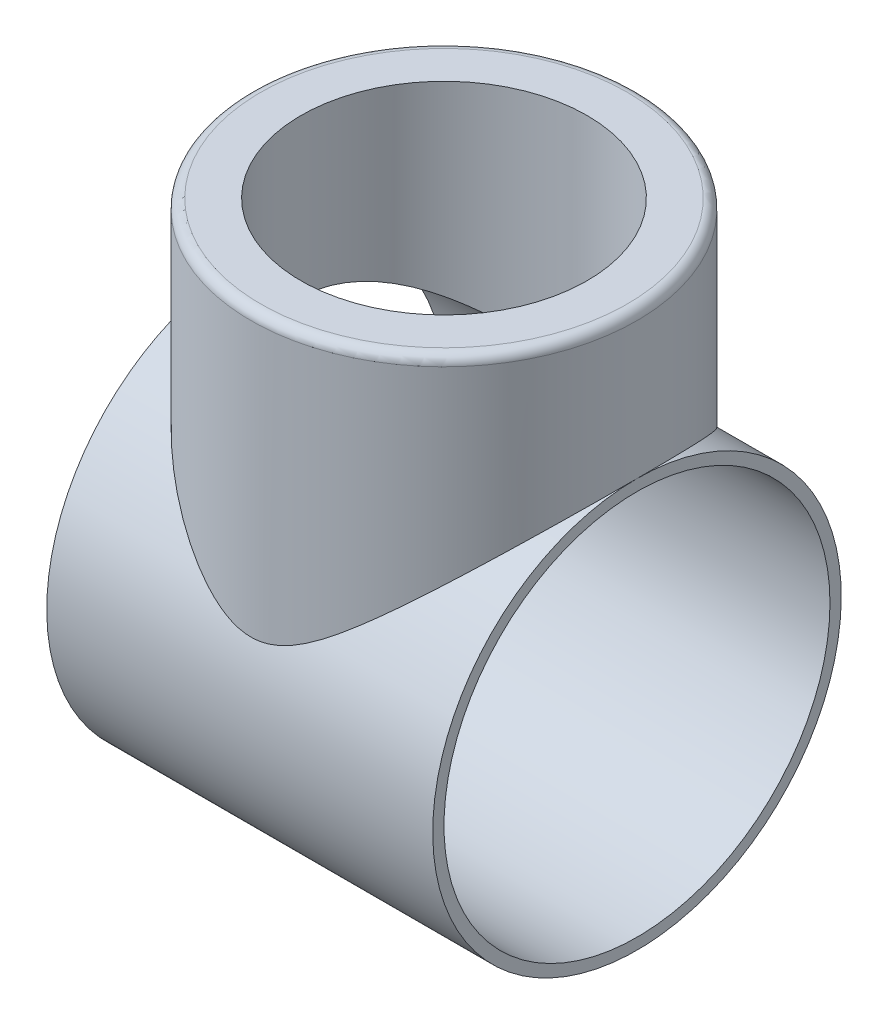
ISO-10303-21;
HEADER;
FILE_DESCRIPTION(('STEP AP214'),'2;1');
FILE_NAME('part.step','',(''),(''),'','','');
FILE_SCHEMA(('AUTOMOTIVE_DESIGN { 1 0 10303 214 1 1 1 1 }'));
ENDSEC;
DATA;
#1=APPLICATION_CONTEXT('core data for automotive mechanical design processes');
#2=APPLICATION_PROTOCOL_DEFINITION('international standard','automotive_design',2000,#1);
#3=PRODUCT_CONTEXT('',#1,'mechanical');
#4=PRODUCT('Part','Part','',(#3));
#5=PRODUCT_RELATED_PRODUCT_CATEGORY('part','',(#4));
#6=PRODUCT_DEFINITION_FORMATION('','',#4);
#7=PRODUCT_DEFINITION_CONTEXT('part definition',#1,'design');
#8=PRODUCT_DEFINITION('design','',#6,#7);
#9=PRODUCT_DEFINITION_SHAPE('','',#8);
#10=(LENGTH_UNIT() NAMED_UNIT(*) SI_UNIT(.MILLI.,.METRE.));
#11=(NAMED_UNIT(*) PLANE_ANGLE_UNIT() SI_UNIT($,.RADIAN.));
#12=(NAMED_UNIT(*) SI_UNIT($,.STERADIAN.) SOLID_ANGLE_UNIT());
#13=UNCERTAINTY_MEASURE_WITH_UNIT(LENGTH_MEASURE(1.E-05),#10,'distance_accuracy_value','');
#14=(GEOMETRIC_REPRESENTATION_CONTEXT(3) GLOBAL_UNCERTAINTY_ASSIGNED_CONTEXT((#13)) GLOBAL_UNIT_ASSIGNED_CONTEXT((#10,
#11,#12)) REPRESENTATION_CONTEXT('',''));
#15=CARTESIAN_POINT('',(0.,0.,0.));
#16=DIRECTION('',(0.,0.,1.));
#17=DIRECTION('',(1.,0.,0.));
#18=AXIS2_PLACEMENT_3D('',#15,#16,#17);
#19=CARTESIAN_POINT('',(-60.,0.,0.));
#20=DIRECTION('',(1.,0.,0.));
#21=DIRECTION('',(0.,0.,-1.));
#22=AXIS2_PLACEMENT_3D('',#19,#20,#21);
#23=CYLINDRICAL_SURFACE('',#22,60.);
#24=CARTESIAN_POINT('',(60.,0.,0.));
#25=DIRECTION('',(1.,0.,0.));
#26=DIRECTION('',(0.,0.,-1.));
#27=AXIS2_PLACEMENT_3D('',#24,#25,#26);
#28=CIRCLE('',#27,60.);
#29=CARTESIAN_POINT('',(60.,0.,-60.));
#30=VERTEX_POINT('',#29);
#31=EDGE_CURVE('E58',#30,#30,#28,.T.);
#32=ORIENTED_EDGE('',*,*,#31,.T.);
#33=EDGE_LOOP('',(#32));
#34=FACE_BOUND('',#33,.T.);
#35=CARTESIAN_POINT('',(-60.,0.,0.));
#36=DIRECTION('',(1.,0.,0.));
#37=DIRECTION('',(0.,0.,-1.));
#38=AXIS2_PLACEMENT_3D('',#35,#36,#37);
#39=CIRCLE('',#38,60.);
#40=CARTESIAN_POINT('',(-60.,0.,-60.));
#41=VERTEX_POINT('',#40);
#42=EDGE_CURVE('E101',#41,#41,#39,.T.);
#43=ORIENTED_EDGE('',*,*,#42,.F.);
#44=EDGE_LOOP('',(#43));
#45=FACE_BOUND('',#44,.T.);
#46=CARTESIAN_POINT('',(0.,40.2461178252015,-44.5));
#47=CARTESIAN_POINT('',(0.521950340710105,40.2461091874401,-44.5000042882494));
#48=CARTESIAN_POINT('',(1.04383948497891,40.2562813467974,-44.4908134860222));
#49=CARTESIAN_POINT('',(2.08624468800879,40.29679076695,-44.4541277588759));
#50=CARTESIAN_POINT('',(2.60676066855394,40.3271291525426,-44.4266318129637));
#51=CARTESIAN_POINT('',(3.64504853630487,40.4075295655595,-44.353517329002));
#52=CARTESIAN_POINT('',(4.16282007227801,40.4575940585679,-44.3078965255041));
#53=CARTESIAN_POINT('',(5.19431452475009,40.5766947814115,-44.1988491619566));
#54=CARTESIAN_POINT('',(5.70803686242041,40.6457336747779,-44.1354201020462));
#55=CARTESIAN_POINT('',(7.24359513295137,40.8802693471307,-43.9186705620038));
#56=CARTESIAN_POINT('',(8.25776608674282,41.0730198952663,-43.7390345051422));
#57=CARTESIAN_POINT('',(10.257564643931,41.5212745320888,-43.3137226483211));
#58=CARTESIAN_POINT('',(11.2431912015059,41.7767809168073,-43.068044432063));
#59=CARTESIAN_POINT('',(13.1683910438996,42.3357936145265,-42.5186066248349));
#60=CARTESIAN_POINT('',(14.1084079437203,42.6386010337178,-42.2156810096681));
#61=CARTESIAN_POINT('',(15.9539269275721,43.2842945061565,-41.5533826240879));
#62=CARTESIAN_POINT('',(16.8594298899541,43.627179538558,-41.1940112913641));
#63=CARTESIAN_POINT('',(18.6345171116782,44.3433852758225,-40.4220393745185));
#64=CARTESIAN_POINT('',(19.5041118289542,44.7166970236494,-40.009454434771));
#65=CARTESIAN_POINT('',(21.2071478906121,45.4853354810806,-39.1334121551078));
#66=CARTESIAN_POINT('',(22.0405865870086,45.8806637983028,-38.6699510978862));
#67=CARTESIAN_POINT('',(23.8366942513597,46.767617311318,-37.5948011891203));
#68=CARTESIAN_POINT('',(24.7912022086411,47.2624844601025,-36.9721303467494));
#69=CARTESIAN_POINT('',(26.6465675245206,48.261565680328,-35.6581377576236));
#70=CARTESIAN_POINT('',(27.5474205383753,48.7657805043797,-34.9668104634265));
#71=CARTESIAN_POINT('',(29.2952372557201,49.7739969690618,-33.5161235927462));
#72=CARTESIAN_POINT('',(30.1421256550589,50.2779973773472,-32.756672361943));
#73=CARTESIAN_POINT('',(31.778415864999,51.275700055055,-31.1717762181585));
#74=CARTESIAN_POINT('',(32.5678130326399,51.7694014904457,-30.346325986402));
#75=CARTESIAN_POINT('',(34.2360957924212,52.8334127397948,-28.4608944512654));
#76=CARTESIAN_POINT('',(35.1017938682631,53.3995579491807,-27.3868198685674));
#77=CARTESIAN_POINT('',(36.7388816469887,54.4896567975256,-25.1480955787368));
#78=CARTESIAN_POINT('',(37.5102508272926,55.0136012466809,-23.9834262512978));
#79=CARTESIAN_POINT('',(38.5884296851264,55.7561611927072,-22.1737546625714));
#80=CARTESIAN_POINT('',(38.9344445874246,55.996289592825,-21.5605741567996));
#81=CARTESIAN_POINT('',(39.5992657729467,56.4605628572466,-20.3137179214327));
#82=CARTESIAN_POINT('',(39.9180737273749,56.6847087031497,-19.6800434539945));
#83=CARTESIAN_POINT('',(40.5269396885394,57.1151163559301,-18.3935670488333));
#84=CARTESIAN_POINT('',(40.8170136671901,57.3213880901394,-17.7407760015974));
#85=CARTESIAN_POINT('',(41.367283893526,57.7145139820236,-16.4168180955821));
#86=CARTESIAN_POINT('',(41.6274729718284,57.9013634792897,-15.7456468750289));
#87=CARTESIAN_POINT('',(42.2160536104265,58.3257078564334,-14.1098261539199));
#88=CARTESIAN_POINT('',(42.5291096534308,58.5528683078576,-13.1368990351965));
#89=CARTESIAN_POINT('',(43.0893465453492,58.9610459401474,-11.1628943464204));
#90=CARTESIAN_POINT('',(43.336542803193,59.1420739139977,-10.1618234217544));
#91=CARTESIAN_POINT('',(43.6554372000947,59.3762755689208,-8.6440871772517));
#92=CARTESIAN_POINT('',(43.7530730054295,59.4481102596546,-8.13557560487839));
#93=CARTESIAN_POINT('',(43.9307501982228,59.5789994743003,-7.11392105689515));
#94=CARTESIAN_POINT('',(44.0107948440874,59.6380563650094,-6.60077895735988));
#95=CARTESIAN_POINT('',(44.1530120978249,59.7430847523843,-5.57062792558039));
#96=CARTESIAN_POINT('',(44.2151826797549,59.7890547657069,-5.05361856180834));
#97=CARTESIAN_POINT('',(44.3214117367221,59.8676564997752,-4.01674246446689));
#98=CARTESIAN_POINT('',(44.3654693389796,59.9002875777797,-3.49687559443048));
#99=CARTESIAN_POINT('',(44.4703501236668,59.9779923563319,-1.9318670440071));
#100=CARTESIAN_POINT('',(44.5035602840376,60.0026399674937,-0.88363602968756));
#101=CARTESIAN_POINT('',(44.4958330595716,59.9969100963708,1.21224592845824));
#102=CARTESIAN_POINT('',(44.4548959647422,59.9665328293014,2.25989687453725));
#103=CARTESIAN_POINT('',(44.2995376296408,59.8514519760434,4.34695695359885));
#104=CARTESIAN_POINT('',(44.1851013218437,59.7667372505429,5.38636435239261));
#105=CARTESIAN_POINT('',(43.8844904701222,59.5448422310987,7.44901649884121));
#106=CARTESIAN_POINT('',(43.6983163060761,59.4076622149783,8.47226133205295));
#107=CARTESIAN_POINT('',(43.2641008547636,59.0890127256266,10.4628678346911));
#108=CARTESIAN_POINT('',(43.01826041709,58.9091228962178,11.4309658277476));
#109=CARTESIAN_POINT('',(42.4650233393857,58.5063437246237,13.3401503805873));
#110=CARTESIAN_POINT('',(42.1576284675576,58.2834556176068,14.2812377153866));
#111=CARTESIAN_POINT('',(41.4846675568433,57.7985571326788,16.1320211676757));
#112=CARTESIAN_POINT('',(41.1190966396067,57.5365434740096,17.0417146448432));
#113=CARTESIAN_POINT('',(40.3333455968536,56.9776492982644,18.8260933971558));
#114=CARTESIAN_POINT('',(39.9131622370173,56.6807667162419,19.7007765948666));
#115=CARTESIAN_POINT('',(38.973005458837,56.022499557773,21.5058204330082));
#116=CARTESIAN_POINT('',(38.447145875456,55.6576115664077,22.4318370619908));
#117=CARTESIAN_POINT('',(37.3370135215526,54.8966231580356,24.2346518194598));
#118=CARTESIAN_POINT('',(36.7527371551884,54.5005208199496,25.1114469129235));
#119=CARTESIAN_POINT('',(35.5293085248845,53.6830922067384,26.8145183935474));
#120=CARTESIAN_POINT('',(34.8901161360653,53.2617475573133,27.6407570734165));
#121=CARTESIAN_POINT('',(33.5606121215878,52.4004604406604,29.2406792745826));
#122=CARTESIAN_POINT('',(32.870298061972,51.9605170883568,30.0143602901862));
#123=CARTESIAN_POINT('',(31.3024484369485,50.9818427894829,31.6532889949493));
#124=CARTESIAN_POINT('',(30.4145893453604,50.4405197225372,32.5071389666396));
#125=CARTESIAN_POINT('',(28.5731712452284,49.3520446269879,34.1370213226318));
#126=CARTESIAN_POINT('',(27.6195994067465,48.8048914778322,34.9130384375959));
#127=CARTESIAN_POINT('',(25.6486318538073,47.7171498458324,36.3855978659591));
#128=CARTESIAN_POINT('',(24.6312091197479,47.1765642592419,37.0821061775823));
#129=CARTESIAN_POINT('',(22.5342509045028,46.116418432799,38.3925212205582));
#130=CARTESIAN_POINT('',(21.4547302842137,45.5968532127562,39.006447598487));
#131=CARTESIAN_POINT('',(19.4624345702153,44.6980671169939,40.0305783513116));
#132=CARTESIAN_POINT('',(18.5609538061182,44.3119394783666,40.456726223778));
#133=CARTESIAN_POINT('',(16.7197604126817,43.572807752645,41.2517262412505));
#134=CARTESIAN_POINT('',(15.7800487337206,43.2198028428767,41.6205798094328));
#135=CARTESIAN_POINT('',(13.8656151236316,42.5581977274057,42.296847572139));
#136=CARTESIAN_POINT('',(12.8909619150813,42.249515755869,42.6043753175112));
#137=CARTESIAN_POINT('',(10.9079654832495,41.6872994375876,43.1546536827896));
#138=CARTESIAN_POINT('',(9.89963037601222,41.4337519145739,43.3974197828659));
#139=CARTESIAN_POINT('',(8.04368455823555,41.0339903275956,43.7752515698321));
#140=CARTESIAN_POINT('',(7.20084207288908,40.8765977494339,43.9219324868934));
#141=CARTESIAN_POINT('',(5.50041819802821,40.6115732475786,44.1671019477012));
#142=CARTESIAN_POINT('',(4.64283865424277,40.5039351388694,44.2655964816223));
#143=CARTESIAN_POINT('',(2.91911830773351,40.3427295547646,44.4125677286822));
#144=CARTESIAN_POINT('',(2.05298633650212,40.2891112096413,44.4610914996129));
#145=CARTESIAN_POINT('',(0.317674362643003,40.2380272726962,44.5073296836804));
#146=CARTESIAN_POINT('',(-0.55150568599144,40.2405625321182,44.505043326576));
#147=CARTESIAN_POINT('',(-2.28596227436666,40.3016700196146,44.4497135761221));
#148=CARTESIAN_POINT('',(-3.15123997960492,40.3602242255133,44.3966865068562));
#149=CARTESIAN_POINT('',(-4.87190451576451,40.5308806498048,44.240941803076));
#150=CARTESIAN_POINT('',(-5.72729134396141,40.642982882947,44.1382241548749));
#151=CARTESIAN_POINT('',(-7.4240653876941,40.9165547676885,43.8847377234221));
#152=CARTESIAN_POINT('',(-8.26543150123807,41.0780927929654,43.7339023771944));
#153=CARTESIAN_POINT('',(-9.92893795590823,41.4448438963211,43.3865023518875));
#154=CARTESIAN_POINT('',(-10.7510755777273,41.6500631108678,43.1899312473468));
#155=CARTESIAN_POINT('',(-12.6870807095658,42.1846332622747,42.6690124944642));
#156=CARTESIAN_POINT('',(-13.7908179644599,42.5312978618984,42.3246484503561));
#157=CARTESIAN_POINT('',(-15.9516144607349,43.2801948728189,41.5585305214342));
#158=CARTESIAN_POINT('',(-17.0086544471686,43.6824499289662,41.1367450758049));
#159=CARTESIAN_POINT('',(-19.0755684632273,44.527930076714,40.2200546403792));
#160=CARTESIAN_POINT('',(-20.0853647652594,44.9712193419744,39.7250343695755));
#161=CARTESIAN_POINT('',(-22.0550882608731,45.884808424398,38.6661782679115));
#162=CARTESIAN_POINT('',(-23.0150204412288,46.355105530638,38.1023493373789));
#163=CARTESIAN_POINT('',(-24.9161621372768,47.3273236161702,36.8883376618597));
#164=CARTESIAN_POINT('',(-25.8556469650214,47.8297762042605,36.2358830733489));
#165=CARTESIAN_POINT('',(-27.679910014823,48.8400529111134,34.8622472738526));
#166=CARTESIAN_POINT('',(-28.5646860737176,49.3478772413438,34.1410633481983));
#167=CARTESIAN_POINT('',(-30.2772938766035,50.358584957203,32.6318457992776));
#168=CARTESIAN_POINT('',(-31.1051561867018,50.8614708686789,31.8438485747471));
#169=CARTESIAN_POINT('',(-32.7017712726705,51.853299207555,30.2019087999941));
#170=CARTESIAN_POINT('',(-33.470525540107,52.3422419866083,29.3479679149222));
#171=CARTESIAN_POINT('',(-34.9471366600719,53.2985479551122,27.5732364539518));
#172=CARTESIAN_POINT('',(-35.6548356260329,53.7658538285782,26.6522832808933));
#173=CARTESIAN_POINT('',(-37.0025002306692,54.6688659515999,24.7472453764052));
#174=CARTESIAN_POINT('',(-37.6424632932466,55.1045709991306,23.7631582461808));
#175=CARTESIAN_POINT('',(-38.8486279933934,55.9354535238626,21.7353357344004));
#176=CARTESIAN_POINT('',(-39.4148771427242,56.3306570707044,20.6916394040002));
#177=CARTESIAN_POINT('',(-40.4677394262983,57.0723077490861,18.5482327967657));
#178=CARTESIAN_POINT('',(-40.954366559355,57.4187634497671,17.4485324110101));
#179=CARTESIAN_POINT('',(-41.7734480273411,58.0060562896384,15.3713226943041));
#180=CARTESIAN_POINT('',(-42.1180999819418,58.2549428335656,14.4008872247955));
#181=CARTESIAN_POINT('',(-42.7416054367343,58.7073143426455,12.4287679411175));
#182=CARTESIAN_POINT('',(-43.0204651989122,58.9108036285294,11.4270871111101));
#183=CARTESIAN_POINT('',(-43.5086322607101,59.2682330369469,9.39874524150024));
#184=CARTESIAN_POINT('',(-43.7179750064187,59.4221984100089,8.37209721993441));
#185=CARTESIAN_POINT('',(-44.0642873146111,59.6774471738407,6.30013580032234));
#186=CARTESIAN_POINT('',(-44.2012560659236,59.7787299741415,5.25482219320709));
#187=CARTESIAN_POINT('',(-44.4009995850255,59.9265736105224,3.14995644098688));
#188=CARTESIAN_POINT('',(-44.4635423875705,59.9729633575138,2.09037013500847));
#189=CARTESIAN_POINT('',(-44.5126410521356,60.0093737571475,-0.0315402479794816));
#190=CARTESIAN_POINT('',(-44.49919675987,59.9993942953369,-1.09386433054349));
#191=CARTESIAN_POINT('',(-44.3965384869147,59.9232964064283,-3.21290418427762));
#192=CARTESIAN_POINT('',(-44.3073172142214,59.8571725765695,-4.26961940586038));
#193=CARTESIAN_POINT('',(-44.0545293478902,59.6702967677894,-6.36918090875246));
#194=CARTESIAN_POINT('',(-43.8909640703089,59.5495457558927,-7.41202743523263));
#195=CARTESIAN_POINT('',(-43.5013980468378,59.2630163329123,-9.42773117519935));
#196=CARTESIAN_POINT('',(-43.2786998341044,59.0996258396571,-10.4015717985618));
#197=CARTESIAN_POINT('',(-42.7709367825483,58.7288085972727,-12.3241853536313));
#198=CARTESIAN_POINT('',(-42.4858743947813,58.5213835788113,-13.2729592688756));
#199=CARTESIAN_POINT('',(-41.8566393162162,58.0661784465417,-15.1407765123869));
#200=CARTESIAN_POINT('',(-41.5124612489804,57.818394662301,-16.0598171274347));
#201=CARTESIAN_POINT('',(-40.7685039846635,57.2865888952406,-17.864256334358));
#202=CARTESIAN_POINT('',(-40.3687215084379,57.0025647753105,-18.7496529382301));
#203=CARTESIAN_POINT('',(-39.4756743282588,56.373476215924,-20.5680435948418));
#204=CARTESIAN_POINT('',(-38.9771009809435,56.0251623487047,-21.4973049359076));
#205=CARTESIAN_POINT('',(-37.9216627541991,55.2960838893367,-23.3087229625223));
#206=CARTESIAN_POINT('',(-37.3647947388914,54.9153175516585,-24.1908771101481));
#207=CARTESIAN_POINT('',(-36.196421767278,54.1271171877636,-25.9065023282224));
#208=CARTESIAN_POINT('',(-35.5848840858751,53.7196672283635,-26.7399437390662));
#209=CARTESIAN_POINT('',(-34.3109233963292,52.8843847752664,-28.3561187012408));
#210=CARTESIAN_POINT('',(-33.6484978667809,52.4565512719992,-29.1388497364131));
#211=CARTESIAN_POINT('',(-32.1442957713006,51.5034469314094,-30.797337438415));
#212=CARTESIAN_POINT('',(-31.2924453848203,50.9751879296599,-31.6622617350211));
#213=CARTESIAN_POINT('',(-29.5241829089023,49.9092126334412,-33.3172559849402));
#214=CARTESIAN_POINT('',(-28.6077594512591,49.3714946862736,-34.1073126999826));
#215=CARTESIAN_POINT('',(-26.7122623392538,48.297870061859,-35.6113733885586));
#216=CARTESIAN_POINT('',(-25.7331462834457,47.7619648741604,-36.3253250006942));
#217=CARTESIAN_POINT('',(-23.7143783853228,46.7052659315094,-37.6742851619448));
#218=CARTESIAN_POINT('',(-22.6747375816564,46.184469446795,-38.3093080404504));
#219=CARTESIAN_POINT('',(-20.7074274646056,45.2539753190545,-39.4018648234355));
#220=CARTESIAN_POINT('',(-19.7885739385137,44.8398636275907,-39.8715266699809));
#221=CARTESIAN_POINT('',(-17.9091303612557,44.0427382109742,-40.7503257680393));
#222=CARTESIAN_POINT('',(-16.9485395648822,43.6597250414274,-41.1594619383084));
#223=CARTESIAN_POINT('',(-14.9886766513092,42.9369595143049,-41.9128813803387));
#224=CARTESIAN_POINT('',(-13.9894816994186,42.5971261433523,-42.2572866992272));
#225=CARTESIAN_POINT('',(-11.9533246844578,41.972544556354,-42.877728409414));
#226=CARTESIAN_POINT('',(-10.9163746735275,41.6877789416741,-43.1537864027726));
#227=CARTESIAN_POINT('',(-9.06795056486468,41.2478015067845,-43.5739296071159));
#228=CARTESIAN_POINT('',(-8.26352200117434,41.0779436302794,-43.7337772467831));
#229=CARTESIAN_POINT('',(-6.63919931287222,40.7822487862483,-44.0096492737428));
#230=CARTESIAN_POINT('',(-5.8193077359748,40.6564046325783,-44.1256808151597));
#231=CARTESIAN_POINT('',(-4.16918296146037,40.4532122182416,-44.3120376887577));
#232=CARTESIAN_POINT('',(-3.33896078214854,40.375816164653,-44.3824080671271));
#233=CARTESIAN_POINT('',(-1.6724406360641,40.2722721227382,-44.4763892223377));
#234=CARTESIAN_POINT('',(-0.836141794890599,40.2461316625205,-44.4999931304106));
#235=CARTESIAN_POINT('',(0.,40.2461178252015,-44.5));
#236=B_SPLINE_CURVE_WITH_KNOTS('',3,(#46,#47,#48,#49,#50,#51,#52,#53,#54,#55,#56,#57,#58,#59,
#60,#61,#62,#63,#64,#65,#66,#67,#68,#69,#70,#71,#72,#73,#74,#75,#76,#77,#78,#79,#80,#81,#82,#83,
#84,#85,#86,#87,#88,#89,#90,#91,#92,#93,#94,#95,#96,#97,#98,#99,#100,#101,#102,#103,#104,#105,
#106,#107,#108,#109,#110,#111,#112,#113,#114,#115,#116,#117,#118,#119,#120,#121,#122,#123,#124,
#125,#126,#127,#128,#129,#130,#131,#132,#133,#134,#135,#136,#137,#138,#139,#140,#141,#142,#143,
#144,#145,#146,#147,#148,#149,#150,#151,#152,#153,#154,#155,#156,#157,#158,#159,#160,#161,#162,
#163,#164,#165,#166,#167,#168,#169,#170,#171,#172,#173,#174,#175,#176,#177,#178,#179,#180,#181,
#182,#183,#184,#185,#186,#187,#188,#189,#190,#191,#192,#193,#194,#195,#196,#197,#198,#199,#200,
#201,#202,#203,#204,#205,#206,#207,#208,#209,#210,#211,#212,#213,#214,#215,#216,#217,#218,#219,
#220,#221,#222,#223,#224,#225,#226,#227,#228,#229,#230,#231,#232,#233,#234,#235),.UNSPECIFIED.,
.T.,.F.,(4,2,2,2,2,2,2,2,2,2,2,2,2,2,2,2,2,2,2,2,2,2,2,2,2,2,2,2,2,2,2,2,2,2,2,2,2,2,2,2,2,2,2,
2,2,2,2,2,2,2,2,2,2,2,2,2,2,2,2,2,2,2,2,2,2,2,2,2,2,2,2,2,2,2,2,2,2,2,2,2,2,2,2,2,2,2,2,2,2,2,2,
2,2,2,4),(0.,1.56556517147146,3.13121767169813,4.69706592637481,6.26313409934394,
9.40144702949159,12.5398747973961,15.6356864170503,18.7314191982175,21.826243924496,
24.9212949274269,28.6453743115329,32.3697548465043,36.099223572733,39.8289931555986,
44.2965662154786,48.7651095360273,50.9960052618935,53.2267638547709,55.4562754288435,
57.6863207501565,60.823899258746,63.9607430356961,65.5286258562801,67.0962180130722,
68.6639877792385,70.2318330800318,73.3745578864826,76.5172704010164,79.660627385307,
82.8039677245902,85.8454248664966,88.8867946525303,91.9284196070492,94.9702247782702,
98.3440535849777,101.718090195545,105.09461339013,108.471297448081,112.503760025058,
116.53701215405,120.57198268409,124.605991574121,127.81141806161,131.016764914371,
134.216120486931,137.4147106213,140.021682558505,142.62833033385,145.23252116116,
147.836751465953,150.440144230556,153.04353771224,155.650548295344,158.257925361325,
161.873592564132,165.490736979422,169.113637051068,172.736174106099,176.48094468703,
180.225863240111,183.968754575554,187.71155142972,191.463753733026,195.216098686979,
198.966012991889,202.715267292296,205.890427517031,209.065285413528,212.238521984498,
215.411794120498,218.594930785149,221.778073912902,224.961523388583,228.144916512222,
231.17841403459,234.211792354927,237.245446700401,240.279280024709,243.607858112388,
246.936615348285,250.267378683901,253.598307159686,257.566177425562,261.534747995964,
265.506031612056,269.476593191306,272.809775718956,276.14301778413,279.46991070141,
282.795750764736,285.306240089339,287.816319333457,290.323918524506,292.831885988828),.UNSPECIFIED.);
#237=CARTESIAN_POINT('',(0.,40.2461178252015,-44.5));
#238=VERTEX_POINT('',#237);
#239=EDGE_CURVE('E19',#238,#238,#236,.T.);
#240=ORIENTED_EDGE('',*,*,#239,.F.);
#241=EDGE_LOOP('',(#240));
#242=FACE_BOUND('',#241,.T.);
#243=ADVANCED_FACE('F14',(#34,#45,#242),#23,.F.);
#244=CARTESIAN_POINT('',(0.,0.,0.));
#245=DIRECTION('',(0.,-1.,0.));
#246=DIRECTION('',(0.,0.,-1.));
#247=AXIS2_PLACEMENT_3D('',#244,#245,#246);
#248=CYLINDRICAL_SURFACE('',#247,60.);
#249=CARTESIAN_POINT('',(0.,106.,0.));
#250=DIRECTION('',(0.,-1.,0.));
#251=DIRECTION('',(0.,0.,-1.));
#252=AXIS2_PLACEMENT_3D('',#249,#250,#251);
#253=CIRCLE('',#252,60.);
#254=CARTESIAN_POINT('',(0.,106.,-60.));
#255=VERTEX_POINT('',#254);
#256=EDGE_CURVE('E9',#255,#255,#253,.T.);
#257=ORIENTED_EDGE('',*,*,#256,.T.);
#258=EDGE_LOOP('',(#257));
#259=FACE_BOUND('',#258,.T.);
#260=CARTESIAN_POINT('',(0.,20.7906228862918,-60.));
#261=CARTESIAN_POINT('',(0.758528909390587,20.7906687322399,-59.9999904065511));
#262=CARTESIAN_POINT('',(1.51729366262084,20.8324790088875,-59.98554699321));
#263=CARTESIAN_POINT('',(3.02541119739763,20.9961734248151,-59.9284381571005));
#264=CARTESIAN_POINT('',(3.77475470966428,21.1181309601118,-59.8857468656814));
#265=CARTESIAN_POINT('',(5.26008636130046,21.4333476508569,-59.7736517022794));
#266=CARTESIAN_POINT('',(5.99598309437329,21.6269798770012,-59.7041079787402));
#267=CARTESIAN_POINT('',(7.44660432062503,22.0731706531462,-59.5405851678695));
#268=CARTESIAN_POINT('',(8.16132786930634,22.3257318274138,-59.4466049922948));
#269=CARTESIAN_POINT('',(9.41850242889429,22.8188288099898,-59.2587975120337));
#270=CARTESIAN_POINT('',(9.96516431764428,23.0504265040595,-59.1692185698772));
#271=CARTESIAN_POINT('',(11.0454442017346,23.5376156349974,-58.9771073554713));
#272=CARTESIAN_POINT('',(11.5790596845841,23.7932116483219,-58.8745726112687));
#273=CARTESIAN_POINT('',(12.6342055594526,24.3241678903389,-58.6572009071734));
#274=CARTESIAN_POINT('',(13.1557274926231,24.5995414317841,-58.5423556346522));
#275=CARTESIAN_POINT('',(14.1871816507752,25.166256868166,-58.3009810156804));
#276=CARTESIAN_POINT('',(14.6971145190673,25.4575978736686,-58.1744523197619));
#277=CARTESIAN_POINT('',(15.7078218450643,26.0541498508793,-57.9097406057808));
#278=CARTESIAN_POINT('',(16.2085648488496,26.3593992025115,-57.7715243095543));
#279=CARTESIAN_POINT('',(17.2002231418555,26.980521261027,-57.4840737539756));
#280=CARTESIAN_POINT('',(17.6911376592914,27.2963947969985,-57.3348386336471));
#281=CARTESIAN_POINT('',(19.1499499190291,28.2565531409301,-56.8710945910735));
#282=CARTESIAN_POINT('',(20.1043443165854,28.9136328016263,-56.5404340934388));
#283=CARTESIAN_POINT('',(22.0039769964669,30.2649996523406,-55.8290004142343));
#284=CARTESIAN_POINT('',(22.9484730965435,30.9597983411099,-55.4472322243461));
#285=CARTESIAN_POINT('',(24.8087273501631,32.3627900030287,-54.640232118589));
#286=CARTESIAN_POINT('',(25.7244808693601,33.0709851069629,-54.2149932402454));
#287=CARTESIAN_POINT('',(27.5301587030445,34.4942177445593,-53.3207838963083));
#288=CARTESIAN_POINT('',(28.4200632243271,35.2092599917402,-52.8517810198544));
#289=CARTESIAN_POINT('',(30.1746375527395,36.6401586498467,-51.8700459354968));
#290=CARTESIAN_POINT('',(31.0393088329444,37.3560150107006,-51.3573162871723));
#291=CARTESIAN_POINT('',(32.7428121268253,38.7830613774666,-50.2883478998282));
#292=CARTESIAN_POINT('',(33.5816780939988,39.4942564530126,-49.7321700686894));
#293=CARTESIAN_POINT('',(35.234669982534,40.9090380230505,-48.5750536608696));
#294=CARTESIAN_POINT('',(36.0487951337687,41.6126242802584,-47.9741136928473));
#295=CARTESIAN_POINT('',(37.6510954118819,43.0081407004995,-46.7271330486956));
#296=CARTESIAN_POINT('',(38.4392848277944,43.7000771756526,-46.0811178399591));
#297=CARTESIAN_POINT('',(39.9888399141275,45.0691221589826,-44.7430488200409));
#298=CARTESIAN_POINT('',(40.7502076319229,45.7462317974337,-44.0509985345428));
#299=CARTESIAN_POINT('',(42.5829204522391,47.3847886646905,-42.2960309164036));
#300=CARTESIAN_POINT('',(43.6385274405875,48.3361625708875,-41.2070707142414));
#301=CARTESIAN_POINT('',(45.6828552063846,50.1895163052427,-38.9283808789139));
#302=CARTESIAN_POINT('',(46.6715760592437,51.0914961890899,-37.7386513593641));
#303=CARTESIAN_POINT('',(48.0968489136662,52.397719369308,-35.8789928350597));
#304=CARTESIAN_POINT('',(48.5620560600246,52.8251053584278,-35.2469780635364));
#305=CARTESIAN_POINT('',(49.4722030615757,53.6629970827709,-33.9576752372917));
#306=CARTESIAN_POINT('',(49.9171443182551,54.0735039850751,-33.3003889360368));
#307=CARTESIAN_POINT('',(50.785239676417,54.8758885887138,-31.9608542168824));
#308=CARTESIAN_POINT('',(51.2084000426182,55.2677716442079,-31.2786130742796));
#309=CARTESIAN_POINT('',(52.0316481010739,56.0314086794391,-29.8891272744113));
#310=CARTESIAN_POINT('',(52.4317299163567,56.4031575305253,-29.1818763216913));
#311=CARTESIAN_POINT('',(53.4326006917372,57.3344775183045,-27.3244873901495));
#312=CARTESIAN_POINT('',(54.0148396806077,57.8775849365436,-26.1559284749153));
#313=CARTESIAN_POINT('',(55.1104563481879,58.9013953354424,-23.7606996871457));
#314=CARTESIAN_POINT('',(55.623849737572,59.3821125528359,-22.5340431593334));
#315=CARTESIAN_POINT('',(56.3369569822265,60.0507779860611,-20.6542203035782));
#316=CARTESIAN_POINT('',(56.5651646691798,60.2649336682026,-20.0209651192068));
#317=CARTESIAN_POINT('',(57.001741284094,60.6748948739397,-18.7418762661228));
#318=CARTESIAN_POINT('',(57.2101134658845,60.8707034071312,-18.0960446814612));
#319=CARTESIAN_POINT('',(57.6062016973035,61.2431214762665,-16.7925461809546));
#320=CARTESIAN_POINT('',(57.7939157959858,61.4197291988699,-16.1348781540904));
#321=CARTESIAN_POINT('',(58.1478526247792,61.7528881498504,-14.8087211107725));
#322=CARTESIAN_POINT('',(58.3140744128745,61.9094384991028,-14.1402316214542));
#323=CARTESIAN_POINT('',(58.6254299614442,62.2027997497841,-12.7884212341209));
#324=CARTESIAN_POINT('',(58.7703922744052,62.3394501114345,-12.1050259204838));
#325=CARTESIAN_POINT('',(59.0369866822571,62.5908445998107,-10.7296289567849));
#326=CARTESIAN_POINT('',(59.1586165304059,62.7055866169215,-10.037626484743));
#327=CARTESIAN_POINT('',(59.3778914230342,62.9125001293602,-8.64649196407175));
#328=CARTESIAN_POINT('',(59.475537005446,63.0046721309006,-7.9473600757112));
#329=CARTESIAN_POINT('',(59.6463168139495,63.165911038749,-6.54346262801519));
#330=CARTESIAN_POINT('',(59.7194513133625,63.2349782026974,-5.83869713158943));
#331=CARTESIAN_POINT('',(59.8407758047187,63.3495702561386,-4.42541956584605));
#332=CARTESIAN_POINT('',(59.8889765473168,63.3951052919398,-3.716909244522));
#333=CARTESIAN_POINT('',(59.9602033516643,63.4623971368019,-2.29757972319877));
#334=CARTESIAN_POINT('',(59.9832322842367,63.4841566574395,-1.58676079577034));
#335=CARTESIAN_POINT('',(60.0039892025269,63.5037692257477,-0.164433052004176));
#336=CARTESIAN_POINT('',(60.0017179853667,63.5016230266065,0.547075741891947));
#337=CARTESIAN_POINT('',(59.9719010196848,63.4734503428098,1.96902100026199));
#338=CARTESIAN_POINT('',(59.9443559975306,63.4474245444525,2.67945749496598));
#339=CARTESIAN_POINT('',(59.8337650199722,63.3429462153451,4.63417148601373));
#340=CARTESIAN_POINT('',(59.7244990534306,63.2397297181741,5.87582573496755));
#341=CARTESIAN_POINT('',(59.4302796460327,62.9619393948515,8.34172373501794));
#342=CARTESIAN_POINT('',(59.2453336712804,62.7873726076638,9.56596919122999));
#343=CARTESIAN_POINT('',(58.8027968147367,62.3699728081123,11.989514771222));
#344=CARTESIAN_POINT('',(58.5451991013245,62.1271333759116,13.1888125377168));
#345=CARTESIAN_POINT('',(57.961305301611,61.5772140343237,15.5554813630102));
#346=CARTESIAN_POINT('',(57.6350054065378,61.2701305633253,16.722850647674));
#347=CARTESIAN_POINT('',(56.9088702964539,60.5875710834974,19.050065571891));
#348=CARTESIAN_POINT('',(56.507334178709,60.2105155945908,20.2089148761408));
#349=CARTESIAN_POINT('',(55.6419501166776,59.3991076301619,22.4822789702302));
#350=CARTESIAN_POINT('',(55.1781030216677,58.9647559355682,23.5967943640572));
#351=CARTESIAN_POINT('',(54.1933504392047,58.0442814595975,25.7781503739198));
#352=CARTESIAN_POINT('',(53.6724420871035,57.5581560790584,26.8449885926276));
#353=CARTESIAN_POINT('',(52.5785531216232,56.5394950047237,28.9288943388254));
#354=CARTESIAN_POINT('',(52.0055613586887,56.0069493746984,29.94595113752));
#355=CARTESIAN_POINT('',(50.9564836787026,55.0343933635614,31.6892273695647));
#356=CARTESIAN_POINT('',(50.4903989534606,54.6030819626321,32.4263828230759));
#357=CARTESIAN_POINT('',(49.5330968526136,53.7191212703474,33.870678097755));
#358=CARTESIAN_POINT('',(49.0418837011452,53.2664755663289,34.5778229274382));
#359=CARTESIAN_POINT('',(47.5326431796392,51.8791349918499,36.6548496992369));
#360=CARTESIAN_POINT('',(46.4792485157517,50.915253822379,37.9799383317709));
#361=CARTESIAN_POINT('',(44.2876354690731,48.9227510920271,40.5144742737073));
#362=CARTESIAN_POINT('',(43.1491544240426,47.8939307220679,41.7235347598777));
#363=CARTESIAN_POINT('',(40.799815617742,45.7886694310987,44.0235959738365));
#364=CARTESIAN_POINT('',(39.5889676055663,44.7122349295989,45.1146125487972));
#365=CARTESIAN_POINT('',(37.5566358288247,42.925635713006,46.8033174342971));
#366=CARTESIAN_POINT('',(36.7546948944416,42.225483667487,47.4355079174354));
#367=CARTESIAN_POINT('',(35.1253194151573,40.8150874837224,48.6543643005233));
#368=CARTESIAN_POINT('',(34.2978833639616,40.1048427505247,49.2410275034114));
#369=CARTESIAN_POINT('',(32.6175047511009,38.6775738556822,50.3698696624441));
#370=CARTESIAN_POINT('',(31.7645426975343,37.9605448147293,50.9120133759927));
#371=CARTESIAN_POINT('',(30.0336692030098,36.5244804865607,51.9518821652084));
#372=CARTESIAN_POINT('',(29.155758762104,35.8054452808009,52.4496090180162));
#373=CARTESIAN_POINT('',(27.3763991281173,34.3720787220823,53.3998838019665));
#374=CARTESIAN_POINT('',(26.4750155378331,33.6577400546386,53.852543505548));
#375=CARTESIAN_POINT('',(24.6447075201963,32.237829488663,54.7143663452147));
#376=CARTESIAN_POINT('',(23.7157797059046,31.532258683524,55.1235241035372));
#377=CARTESIAN_POINT('',(21.8287917760074,30.138706864775,55.8976090636547));
#378=CARTESIAN_POINT('',(20.8707704289991,29.4507045136316,56.2625921516717));
#379=CARTESIAN_POINT('',(18.9203529914622,28.1021712098136,56.9481250825322));
#380=CARTESIAN_POINT('',(17.9279688275069,27.4416308974152,57.2686901524572));
#381=CARTESIAN_POINT('',(16.2347758220797,26.3731023134669,57.7662059172242));
#382=CARTESIAN_POINT('',(15.5451042326864,25.9533452186927,57.9557727293178));
#383=CARTESIAN_POINT('',(14.145000998825,25.1397301303381,58.3133016256247));
#384=CARTESIAN_POINT('',(13.4345684860103,24.7458732223051,58.4812628045688));
#385=CARTESIAN_POINT('',(11.9915601861318,23.993105210065,58.794105374896));
#386=CARTESIAN_POINT('',(11.2590148117499,23.6341487403093,58.9390168877664));
#387=CARTESIAN_POINT('',(9.76890030891742,22.9617010121501,59.2042300029197));
#388=CARTESIAN_POINT('',(9.01133819327823,22.6481971428825,59.3245384351666));
#389=CARTESIAN_POINT('',(7.66394620885365,22.1517197827822,59.5113698196047));
#390=CARTESIAN_POINT('',(7.07975187207299,21.9557353810002,59.583813090906));
#391=CARTESIAN_POINT('',(5.89778570076965,21.6036089820242,59.7123876813954));
#392=CARTESIAN_POINT('',(5.30001891891906,21.4474524144445,59.7685249669181));
#393=CARTESIAN_POINT('',(4.09422584327693,21.1817843970081,59.8631939386489));
#394=CARTESIAN_POINT('',(3.4862280029898,21.0721605455251,59.9017680659426));
#395=CARTESIAN_POINT('',(2.26220406470628,20.9045528992181,59.9604675581135));
#396=CARTESIAN_POINT('',(1.64617858093479,20.8465651767879,59.9805943261582));
#397=CARTESIAN_POINT('',(0.406796236364865,20.7853299263221,60.0018431849288));
#398=CARTESIAN_POINT('',(-0.21658193180487,20.782460444376,60.0028340260279));
#399=CARTESIAN_POINT('',(-1.46078189065839,20.8326035275548,59.985442278827));
#400=CARTESIAN_POINT('',(-2.08160363194148,20.8856171675315,59.9670593178927));
#401=CARTESIAN_POINT('',(-3.31671831080052,21.0445852806879,59.9114546959283));
#402=CARTESIAN_POINT('',(-3.93099594436179,21.1506440349662,59.8741959251749));
#403=CARTESIAN_POINT('',(-5.14799615984707,21.4102311635758,59.7818607643608));
#404=CARTESIAN_POINT('',(-5.7507166496707,21.5637680479414,59.7267811799951));
#405=CARTESIAN_POINT('',(-7.22135694427491,21.9931303830577,59.5703433546844));
#406=CARTESIAN_POINT('',(-8.08135503699839,22.2925568468197,59.459390890244));
#407=CARTESIAN_POINT('',(-9.76992230889682,22.9586099987819,59.2053970578338));
#408=CARTESIAN_POINT('',(-10.5984702437983,23.3252811683373,59.0623344353738));
#409=CARTESIAN_POINT('',(-12.2287783127481,24.1097614729603,58.746479888434));
#410=CARTESIAN_POINT('',(-13.0304255363341,24.5277583980892,58.5735777926153));
#411=CARTESIAN_POINT('',(-14.606629561452,25.4002579302588,58.2005340027037));
#412=CARTESIAN_POINT('',(-15.381190805212,25.8547545104959,58.000396801882));
#413=CARTESIAN_POINT('',(-17.0118428044231,26.8548428987068,57.5448468491374));
#414=CARTESIAN_POINT('',(-17.8644479805037,27.4043540722059,57.2856174903084));
#415=CARTESIAN_POINT('',(-19.543279473811,28.527194033868,56.7348277230435));
#416=CARTESIAN_POINT('',(-20.3694992682183,29.1005286321142,56.4432593984596));
#417=CARTESIAN_POINT('',(-21.9992618422014,30.2637023339719,55.8282333428868));
#418=CARTESIAN_POINT('',(-22.8027836810337,30.8535557389622,55.5047473265184));
#419=CARTESIAN_POINT('',(-24.3886372665535,32.0434251983279,54.8264349792148));
#420=CARTESIAN_POINT('',(-25.1709707940348,32.643440391713,54.4716112928341));
#421=CARTESIAN_POINT('',(-26.7172922178668,33.8501069518441,53.730090001806));
#422=CARTESIAN_POINT('',(-27.4812507569071,34.4567669411775,53.3433452676084));
#423=CARTESIAN_POINT('',(-28.9906404962924,35.6722178063826,52.5383127204357));
#424=CARTESIAN_POINT('',(-29.7360714479202,36.281008710735,52.1200244843195));
#425=CARTESIAN_POINT('',(-31.2086452758759,37.4974332369504,51.2518358260864));
#426=CARTESIAN_POINT('',(-31.9357955085427,38.1050672303482,50.8019484055169));
#427=CARTESIAN_POINT('',(-33.3722766591617,39.3167920231314,49.870072085474));
#428=CARTESIAN_POINT('',(-34.0816073882599,39.9208827849132,49.3880828459779));
#429=CARTESIAN_POINT('',(-35.562129203882,41.191683200239,48.3347883914542));
#430=CARTESIAN_POINT('',(-36.331151920835,41.8576791485035,47.7595654971656));
#431=CARTESIAN_POINT('',(-37.8461742604983,43.1792288351404,46.5681837635291));
#432=CARTESIAN_POINT('',(-38.5921734204128,43.834782363482,45.9520241020963));
#433=CARTESIAN_POINT('',(-40.0603124376432,45.132703448277,44.6779183477359));
#434=CARTESIAN_POINT('',(-40.782443206548,45.7750659474892,44.0199566101737));
#435=CARTESIAN_POINT('',(-42.201053362428,47.0433627335256,42.661871342333));
#436=CARTESIAN_POINT('',(-42.8975331462097,47.6692972744381,41.9617484647058));
#437=CARTESIAN_POINT('',(-44.2609049256129,48.8998143820474,40.5210175073272));
#438=CARTESIAN_POINT('',(-44.9278811753656,49.5044565887796,39.7805402872031));
#439=CARTESIAN_POINT('',(-46.2323436227258,50.6912847640404,38.2567162942638));
#440=CARTESIAN_POINT('',(-46.8698286547504,51.2734698448442,37.4733678297131));
#441=CARTESIAN_POINT('',(-48.1123681622239,52.4117157514376,35.864087050533));
#442=CARTESIAN_POINT('',(-48.7174420608969,52.9677921982708,35.0381808354609));
#443=CARTESIAN_POINT('',(-49.8925851930702,54.0506056360251,33.3435603311628));
#444=CARTESIAN_POINT('',(-50.4626596112058,54.5773469714132,32.474852416884));
#445=CARTESIAN_POINT('',(-51.6999340537438,55.7231195826794,30.476480117449));
#446=CARTESIAN_POINT('',(-52.3566644086509,56.3331017236956,29.3350678509573));
#447=CARTESIAN_POINT('',(-53.6041104557303,57.4943370151523,26.9882327473561));
#448=CARTESIAN_POINT('',(-54.1948377861362,58.0456005185765,25.782821250626));
#449=CARTESIAN_POINT('',(-55.3028391398836,59.0814298893703,23.3115648644228));
#450=CARTESIAN_POINT('',(-55.82014000171,59.5660201248308,22.0457422833469));
#451=CARTESIAN_POINT('',(-56.7739730326628,60.4607864226878,19.4580612763681));
#452=CARTESIAN_POINT('',(-57.2105026371027,60.8709601221678,18.1362010727702));
#453=CARTESIAN_POINT('',(-57.8007267910454,61.4261308181702,16.1113950707765));
#454=CARTESIAN_POINT('',(-57.9874127712145,61.6018391117936,15.4262120958629));
#455=CARTESIAN_POINT('',(-58.3374041299346,61.9314075349646,14.0447392458252));
#456=CARTESIAN_POINT('',(-58.5007123385065,62.0852703090262,13.348450726456));
#457=CARTESIAN_POINT('',(-58.8031402422415,62.37031948222,11.9459393581317));
#458=CARTESIAN_POINT('',(-58.9422563834057,62.5015025495141,11.2397150659805));
#459=CARTESIAN_POINT('',(-59.1955130783151,62.740393688889,9.81895124098046));
#460=CARTESIAN_POINT('',(-59.3096568654099,62.848104800045,9.1044127972569));
#461=CARTESIAN_POINT('',(-59.5122928987245,63.0393677528273,7.66890692232725));
#462=CARTESIAN_POINT('',(-59.600799500843,63.1229331151367,6.94794332303389));
#463=CARTESIAN_POINT('',(-59.7517239443748,63.2654558007023,5.50095812532444));
#464=CARTESIAN_POINT('',(-59.8141451118529,63.3244162612443,4.77493718376204));
#465=CARTESIAN_POINT('',(-59.9125411076332,63.4173660881438,3.31954284305952));
#466=CARTESIAN_POINT('',(-59.948517092367,63.4513565464241,2.59016959191755));
#467=CARTESIAN_POINT('',(-59.9938077638634,63.4941486592253,1.12987181716076));
#468=CARTESIAN_POINT('',(-60.0031233492999,63.5029511627869,0.398947346665935));
#469=CARTESIAN_POINT('',(-59.9955648266933,63.4958093154703,-0.967958496528806));
#470=CARTESIAN_POINT('',(-59.9819259055395,63.4829219168062,-1.6039778243444));
#471=CARTESIAN_POINT('',(-59.9344696401623,63.4380847001962,-2.87464688972412));
#472=CARTESIAN_POINT('',(-59.9006505868162,63.4061332676538,-3.50929650671317));
#473=CARTESIAN_POINT('',(-59.8129923027164,63.3233277660118,-4.77585322987539));
#474=CARTESIAN_POINT('',(-59.7591570784979,63.2724774798005,-5.40776085930724));
#475=CARTESIAN_POINT('',(-59.6317156906658,63.1521265361285,-6.66781363904767));
#476=CARTESIAN_POINT('',(-59.5581075644902,63.0826240273395,-7.29595840954292));
#477=CARTESIAN_POINT('',(-59.3080827836329,62.8466036531325,-9.17297148525979));
#478=CARTESIAN_POINT('',(-59.1024447948381,62.6525531478352,-10.4147182262867));
#479=CARTESIAN_POINT('',(-58.6167591889885,62.1945973466314,-12.8702342859526));
#480=CARTESIAN_POINT('',(-58.3367086016048,61.9306892622204,-14.0840024856694));
#481=CARTESIAN_POINT('',(-57.7100015478257,61.3407142955875,-16.463685618724));
#482=CARTESIAN_POINT('',(-57.3641083663049,61.015360042641,-17.6299791201628));
#483=CARTESIAN_POINT('',(-56.608553678171,60.3055684631369,-19.9230807615385));
#484=CARTESIAN_POINT('',(-56.1988947678094,59.9211335420845,-21.0498905067877));
#485=CARTESIAN_POINT('',(-55.3207434138154,59.0983173899384,-23.2600440438987));
#486=CARTESIAN_POINT('',(-54.8522455668947,58.6599312044746,-24.3433838317625));
#487=CARTESIAN_POINT('',(-53.861285669114,57.7343636462477,-26.4637822601103));
#488=CARTESIAN_POINT('',(-53.3388122451558,57.2471719904283,-27.500831080513));
#489=CARTESIAN_POINT('',(-52.3889698406638,56.3633957674972,-29.259436424528));
#490=CARTESIAN_POINT('',(-51.9728151953931,55.9767610641628,-29.9921232903096));
#491=CARTESIAN_POINT('',(-51.1157596421068,55.1819284837638,-31.4305576832213));
#492=CARTESIAN_POINT('',(-50.6748631796575,54.7737344812066,-32.136310011858));
#493=CARTESIAN_POINT('',(-49.3170999662079,53.5192123515485,-34.2134573931225));
#494=CARTESIAN_POINT('',(-48.3653338214381,52.6431066845714,-35.5444222710038));
#495=CARTESIAN_POINT('',(-46.3788184091042,50.8240590270627,-38.1003035628409));
#496=CARTESIAN_POINT('',(-45.3438610810192,49.8809501915522,-39.32493707926));
#497=CARTESIAN_POINT('',(-43.2027194272396,47.9428552948353,-41.6658221487644));
#498=CARTESIAN_POINT('',(-42.0965390556095,46.9478721141011,-42.7820797099056));
#499=CARTESIAN_POINT('',(-40.2064302868391,45.2624736428017,-44.5477544674517));
#500=CARTESIAN_POINT('',(-39.4403564109539,44.5831323145076,-45.2271663401912));
#501=CARTESIAN_POINT('',(-37.8818477873352,43.2105078996869,-46.540348271039));
#502=CARTESIAN_POINT('',(-37.089411246715,42.5172238662104,-47.1741152155871));
#503=CARTESIAN_POINT('',(-35.4789521738251,41.1198933091536,-48.396971577915));
#504=CARTESIAN_POINT('',(-34.6609153926957,40.4158409075948,-48.9860354664777));
#505=CARTESIAN_POINT('',(-33.0003075284589,39.0010407184268,-50.119761098706));
#506=CARTESIAN_POINT('',(-32.1577372211001,38.2902931429984,-50.6644242442556));
#507=CARTESIAN_POINT('',(-30.4490729831921,36.8669598937639,-51.7093385919691));
#508=CARTESIAN_POINT('',(-29.5830080569939,36.1543773886615,-52.2096415656974));
#509=CARTESIAN_POINT('',(-27.8256581519402,34.7311285759404,-53.1670401249722));
#510=CARTESIAN_POINT('',(-26.9343714604261,34.0204624020543,-53.6241327671728));
#511=CARTESIAN_POINT('',(-25.1258248252378,32.6073398840306,-54.4949495594716));
#512=CARTESIAN_POINT('',(-24.2085864568008,31.904877368526,-54.9087084637162));
#513=CARTESIAN_POINT('',(-22.3449755643383,30.5149443004885,-55.6931263449374));
#514=CARTESIAN_POINT('',(-21.3986087449948,29.8274708569016,-56.0637936941324));
#515=CARTESIAN_POINT('',(-19.675613056459,28.619688345719,-56.6879471908932));
#516=CARTESIAN_POINT('',(-18.9052559185587,28.0946895717881,-56.9496640726384));
#517=CARTESIAN_POINT('',(-17.3410211074443,27.0668241712749,-57.4452982374671));
#518=CARTESIAN_POINT('',(-16.5471427806285,26.5639581606798,-57.6792147471332));
#519=CARTESIAN_POINT('',(-14.9331133108962,25.5897236238593,-58.1179936672118));
#520=CARTESIAN_POINT('',(-14.1129804471931,25.1183338593669,-58.3228757752121));
#521=CARTESIAN_POINT('',(-12.4422523256133,24.2190798118309,-58.7019917209435));
#522=CARTESIAN_POINT('',(-11.5916668925531,23.791201658851,-58.8762353381179));
#523=CARTESIAN_POINT('',(-10.1079983535899,23.1110901117273,-59.1457542845923));
#524=CARTESIAN_POINT('',(-9.48330374745816,22.8438858827683,-59.2492821337488));
#525=CARTESIAN_POINT('',(-8.21602229594313,22.3475529356676,-59.4382650546879));
#526=CARTESIAN_POINT('',(-7.57343358899582,22.1184281964296,-59.5237182381131));
#527=CARTESIAN_POINT('',(-6.27313840663839,21.7076776101193,-59.6747400129474));
#528=CARTESIAN_POINT('',(-5.61548874890362,21.5258976752118,-59.7403732243));
#529=CARTESIAN_POINT('',(-4.28578537826407,21.2179349544762,-59.850449047694));
#530=CARTESIAN_POINT('',(-3.61374296616383,21.0917101136825,-59.894907690893));
#531=CARTESIAN_POINT('',(-2.45075155215789,20.9290297879869,-59.9519040948818));
#532=CARTESIAN_POINT('',(-1.96218341195367,20.8772967138732,-59.969908212552));
#533=CARTESIAN_POINT('',(-0.982442747121104,20.8080822970911,-59.9939579169726));
#534=CARTESIAN_POINT('',(-0.491270837902535,20.7905931935838,-60.0000062133185));
#535=CARTESIAN_POINT('',(0.,20.7906228862918,-60.));
#536=B_SPLINE_CURVE_WITH_KNOTS('',3,(#260,#261,#262,#263,#264,#265,#266,#267,#268,#269,#270,
#271,#272,#273,#274,#275,#276,#277,#278,#279,#280,#281,#282,#283,#284,#285,#286,#287,#288,#289,
#290,#291,#292,#293,#294,#295,#296,#297,#298,#299,#300,#301,#302,#303,#304,#305,#306,#307,#308,
#309,#310,#311,#312,#313,#314,#315,#316,#317,#318,#319,#320,#321,#322,#323,#324,#325,#326,#327,
#328,#329,#330,#331,#332,#333,#334,#335,#336,#337,#338,#339,#340,#341,#342,#343,#344,#345,#346,
#347,#348,#349,#350,#351,#352,#353,#354,#355,#356,#357,#358,#359,#360,#361,#362,#363,#364,#365,
#366,#367,#368,#369,#370,#371,#372,#373,#374,#375,#376,#377,#378,#379,#380,#381,#382,#383,#384,
#385,#386,#387,#388,#389,#390,#391,#392,#393,#394,#395,#396,#397,#398,#399,#400,#401,#402,#403,
#404,#405,#406,#407,#408,#409,#410,#411,#412,#413,#414,#415,#416,#417,#418,#419,#420,#421,#422,
#423,#424,#425,#426,#427,#428,#429,#430,#431,#432,#433,#434,#435,#436,#437,#438,#439,#440,#441,
#442,#443,#444,#445,#446,#447,#448,#449,#450,#451,#452,#453,#454,#455,#456,#457,#458,#459,#460,
#461,#462,#463,#464,#465,#466,#467,#468,#469,#470,#471,#472,#473,#474,#475,#476,#477,#478,#479,
#480,#481,#482,#483,#484,#485,#486,#487,#488,#489,#490,#491,#492,#493,#494,#495,#496,#497,#498,
#499,#500,#501,#502,#503,#504,#505,#506,#507,#508,#509,#510,#511,#512,#513,#514,#515,#516,#517,
#518,#519,#520,#521,#522,#523,#524,#525,#526,#527,#528,#529,#530,#531,#532,#533,#534,#535),
.UNSPECIFIED.,.T.,.F.,(4,2,2,2,2,2,2,2,2,2,2,2,2,2,2,2,2,2,2,2,2,2,2,2,2,2,2,2,2,2,2,2,2,2,2,2,
2,2,2,2,2,2,2,2,2,2,2,2,2,2,2,2,2,2,2,2,2,2,2,2,2,2,2,2,2,2,2,2,2,2,2,2,2,2,2,2,2,2,2,2,2,2,2,2,
2,2,2,2,2,2,2,2,2,2,2,2,2,2,2,2,2,2,2,2,2,2,2,2,2,2,2,2,2,2,2,2,2,2,2,2,2,2,2,2,2,2,2,2,2,2,2,2,
2,2,2,2,2,4),(0.,2.27477774704131,4.55164156316736,6.84052715918305,9.12951470498148,
10.9299653278367,12.7307599949467,14.5327783931341,16.3346965154922,18.141930135997,
19.9493051178018,23.5625217403692,27.2606455575169,30.9593626147631,34.6608409531296,
38.3621027712236,42.0582660022256,45.7545441690339,49.448750599825,53.1426744278283,
58.5091514388793,63.8756223994084,66.5558000731324,69.2357921169974,71.9150089718899,
74.5949051066864,78.8329239125443,83.0699739440415,85.1885501328229,87.3067781878718,
89.4252061166787,91.5437268654981,93.6784898296907,95.8134582525358,97.9483787867686,
100.083275513858,102.217250971486,104.350983025671,106.484647853367,108.618251361579,
112.365518325055,116.112415696307,119.859665515014,123.607123131763,127.452648797824,
131.298122056043,135.143788457244,138.990280052231,141.908148029823,144.825527109784,
150.661781341374,156.51686210846,162.371155864151,166.084548874822,169.798161701307,
173.514686519646,177.231062571243,180.937979062561,184.64535327583,188.347987074659,
192.049348404751,194.536567455358,197.02389068574,199.507936272764,201.991291334798,
203.8512173347,205.710461930832,207.565189531835,209.419776044377,211.287078324015,
213.154416519865,215.025440220571,216.896799480284,219.644109709103,222.393243840262,
225.152754221251,227.911809886529,231.051321048121,234.191602423453,237.334692139589,
240.477516866525,243.625067768734,246.772660901368,249.918966452535,253.065305334708,
256.57038947819,260.07554403144,263.582018223236,267.088438149023,270.584095599558,
274.079891091284,277.573567643488,281.066725406221,285.416601887301,289.765710145426,
294.113224622399,298.460877119986,300.654950854023,302.848758757122,305.042888675546,
307.236734335897,309.42934913642,311.621684278741,313.813923545885,316.00608891572,
317.91438304262,319.822838812258,321.730912781474,323.639176206849,327.454802885108,
331.270581894679,335.044558623878,338.818381734027,342.592551655092,346.367518453135,
349.147826516555,351.927636608743,357.48845106494,363.063633748737,368.638507183513,
372.323829803421,376.009403571223,379.697066516227,383.384612983916,387.067797555696,
390.751232833408,394.431690960174,398.111432814836,401.015499058924,403.919646076397,
406.821813325436,409.72305254886,411.78366986526,413.844502359189,415.898541425653,
417.951022907821,419.424645485934,420.897934052784),.UNSPECIFIED.);
#537=CARTESIAN_POINT('',(60.,63.5,0.));
#538=VERTEX_POINT('',#537);
#539=CARTESIAN_POINT('',(-60.,63.5,0.));
#540=VERTEX_POINT('',#539);
#541=EDGE_CURVE('E38',#538,#540,#536,.T.);
#542=ORIENTED_EDGE('',*,*,#541,.F.);
#543=EDGE_CURVE('E36',#540,#538,#536,.T.);
#544=ORIENTED_EDGE('',*,*,#543,.F.);
#545=EDGE_LOOP('',(#542,#544));
#546=FACE_BOUND('',#545,.T.);
#547=ADVANCED_FACE('F16',(#259,#546),#248,.T.);
#548=CARTESIAN_POINT('',(0.,0.,0.));
#549=DIRECTION('',(0.,-1.,0.));
#550=DIRECTION('',(0.,0.,-1.));
#551=AXIS2_PLACEMENT_3D('',#548,#549,#550);
#552=CYLINDRICAL_SURFACE('',#551,44.5);
#553=CARTESIAN_POINT('',(0.,109.,0.));
#554=DIRECTION('',(0.,-1.,0.));
#555=DIRECTION('',(0.,0.,-1.));
#556=AXIS2_PLACEMENT_3D('',#553,#554,#555);
#557=CIRCLE('',#556,44.5);
#558=CARTESIAN_POINT('',(0.,109.,-44.5));
#559=VERTEX_POINT('',#558);
#560=EDGE_CURVE('E43',#559,#559,#557,.T.);
#561=ORIENTED_EDGE('',*,*,#560,.F.);
#562=EDGE_LOOP('',(#561));
#563=FACE_BOUND('',#562,.T.);
#564=ORIENTED_EDGE('',*,*,#239,.T.);
#565=EDGE_LOOP('',(#564));
#566=FACE_BOUND('',#565,.T.);
#567=ADVANCED_FACE('F76',(#563,#566),#552,.F.);
#568=CARTESIAN_POINT('',(0.,106.,0.));
#569=DIRECTION('',(0.,-1.,0.));
#570=DIRECTION('',(0.,0.,-1.));
#571=AXIS2_PLACEMENT_3D('',#568,#569,#570);
#572=TOROIDAL_SURFACE('',#571,57.,3.);
#573=ORIENTED_EDGE('',*,*,#256,.F.);
#574=EDGE_LOOP('',(#573));
#575=FACE_BOUND('',#574,.T.);
#576=CARTESIAN_POINT('',(0.,109.,0.));
#577=DIRECTION('',(0.,-1.,0.));
#578=DIRECTION('',(0.,0.,-1.));
#579=AXIS2_PLACEMENT_3D('',#576,#577,#578);
#580=CIRCLE('',#579,57.);
#581=CARTESIAN_POINT('',(0.,109.,-57.));
#582=VERTEX_POINT('',#581);
#583=EDGE_CURVE('E30',#582,#582,#580,.T.);
#584=ORIENTED_EDGE('',*,*,#583,.T.);
#585=EDGE_LOOP('',(#584));
#586=FACE_BOUND('',#585,.T.);
#587=ADVANCED_FACE('F79',(#575,#586),#572,.T.);
#588=CARTESIAN_POINT('',(0.,109.,57.));
#589=DIRECTION('',(0.,-1.,0.));
#590=DIRECTION('',(0.,0.,-1.));
#591=AXIS2_PLACEMENT_3D('',#588,#589,#590);
#592=PLANE('',#591);
#593=ORIENTED_EDGE('',*,*,#583,.F.);
#594=EDGE_LOOP('',(#593));
#595=FACE_BOUND('',#594,.T.);
#596=ORIENTED_EDGE('',*,*,#560,.T.);
#597=EDGE_LOOP('',(#596));
#598=FACE_BOUND('',#597,.T.);
#599=ADVANCED_FACE('F70',(#595,#598),#592,.F.);
#600=CARTESIAN_POINT('',(60.,0.,0.));
#601=DIRECTION('',(-1.,0.,0.));
#602=DIRECTION('',(0.,0.,1.));
#603=AXIS2_PLACEMENT_3D('',#600,#601,#602);
#604=CYLINDRICAL_SURFACE('',#603,63.5);
#605=CARTESIAN_POINT('',(60.,0.,0.));
#606=DIRECTION('',(1.,0.,0.));
#607=DIRECTION('',(0.,0.,-1.));
#608=AXIS2_PLACEMENT_3D('',#605,#606,#607);
#609=CIRCLE('',#608,63.5);
#610=EDGE_CURVE('E47',#538,#538,#609,.T.);
#611=ORIENTED_EDGE('',*,*,#610,.F.);
#612=ORIENTED_EDGE('',*,*,#541,.T.);
#613=CARTESIAN_POINT('',(-60.,0.,0.));
#614=DIRECTION('',(1.,0.,0.));
#615=DIRECTION('',(0.,0.,-1.));
#616=AXIS2_PLACEMENT_3D('',#613,#614,#615);
#617=CIRCLE('',#616,63.5);
#618=EDGE_CURVE('E49',#540,#540,#617,.T.);
#619=ORIENTED_EDGE('',*,*,#618,.T.);
#620=ORIENTED_EDGE('',*,*,#543,.T.);
#621=EDGE_LOOP('',(#611,#612,#619,#620));
#622=FACE_BOUND('',#621,.T.);
#623=ADVANCED_FACE('F46',(#622),#604,.T.);
#624=CARTESIAN_POINT('',(60.,0.,0.));
#625=DIRECTION('',(1.,0.,0.));
#626=DIRECTION('',(0.,0.,-1.));
#627=AXIS2_PLACEMENT_3D('',#624,#625,#626);
#628=PLANE('',#627);
#629=ORIENTED_EDGE('',*,*,#31,.F.);
#630=EDGE_LOOP('',(#629));
#631=FACE_BOUND('',#630,.T.);
#632=ORIENTED_EDGE('',*,*,#610,.T.);
#633=EDGE_LOOP('',(#632));
#634=FACE_BOUND('',#633,.T.);
#635=ADVANCED_FACE('F52',(#631,#634),#628,.T.);
#636=CARTESIAN_POINT('',(-60.,0.,0.));
#637=DIRECTION('',(1.,0.,0.));
#638=DIRECTION('',(0.,0.,-1.));
#639=AXIS2_PLACEMENT_3D('',#636,#637,#638);
#640=PLANE('',#639);
#641=ORIENTED_EDGE('',*,*,#42,.T.);
#642=EDGE_LOOP('',(#641));
#643=FACE_BOUND('',#642,.T.);
#644=ORIENTED_EDGE('',*,*,#618,.F.);
#645=EDGE_LOOP('',(#644));
#646=FACE_BOUND('',#645,.T.);
#647=ADVANCED_FACE('F113',(#643,#646),#640,.F.);
#648=CLOSED_SHELL('',(#243,#547,#567,#587,#599,#623,#635,#647));
#649=MANIFOLD_SOLID_BREP('B1',#648);
#650=ADVANCED_BREP_SHAPE_REPRESENTATION('',(#18,#649),#14);
#651=SHAPE_DEFINITION_REPRESENTATION(#9,#650);
ENDSEC;
END-ISO-10303-21;
